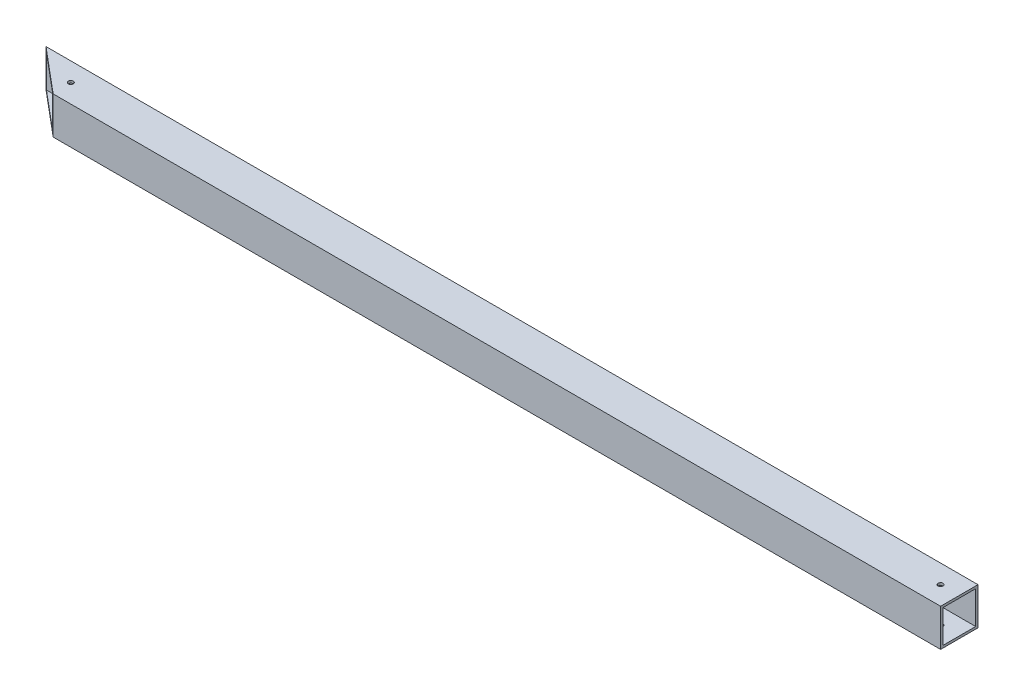
ISO-10303-21;
HEADER;
FILE_DESCRIPTION(('STEP AP214'),'2;1');
FILE_NAME('part.step','',(''),(''),'','','');
FILE_SCHEMA(('AUTOMOTIVE_DESIGN { 1 0 10303 214 1 1 1 1 }'));
ENDSEC;
DATA;
#1=APPLICATION_CONTEXT('core data for automotive mechanical design processes');
#2=APPLICATION_PROTOCOL_DEFINITION('international standard','automotive_design',2000,#1);
#3=PRODUCT_CONTEXT('',#1,'mechanical');
#4=PRODUCT('Part','Part','',(#3));
#5=PRODUCT_RELATED_PRODUCT_CATEGORY('part','',(#4));
#6=PRODUCT_DEFINITION_FORMATION('','',#4);
#7=PRODUCT_DEFINITION_CONTEXT('part definition',#1,'design');
#8=PRODUCT_DEFINITION('design','',#6,#7);
#9=PRODUCT_DEFINITION_SHAPE('','',#8);
#10=(LENGTH_UNIT() NAMED_UNIT(*) SI_UNIT(.MILLI.,.METRE.));
#11=(NAMED_UNIT(*) PLANE_ANGLE_UNIT() SI_UNIT($,.RADIAN.));
#12=(NAMED_UNIT(*) SI_UNIT($,.STERADIAN.) SOLID_ANGLE_UNIT());
#13=UNCERTAINTY_MEASURE_WITH_UNIT(LENGTH_MEASURE(1.E-05),#10,'distance_accuracy_value','');
#14=(GEOMETRIC_REPRESENTATION_CONTEXT(3) GLOBAL_UNCERTAINTY_ASSIGNED_CONTEXT((#13)) GLOBAL_UNIT_ASSIGNED_CONTEXT((#10,
#11,#12)) REPRESENTATION_CONTEXT('',''));
#15=CARTESIAN_POINT('',(0.,0.,0.));
#16=DIRECTION('',(0.,0.,1.));
#17=DIRECTION('',(1.,0.,0.));
#18=AXIS2_PLACEMENT_3D('',#15,#16,#17);
#19=CARTESIAN_POINT('',(1434.71069902318,-215.9,1156.61312053318));
#20=DIRECTION('',(1.,0.,0.));
#21=DIRECTION('',(0.,0.,-1.));
#22=AXIS2_PLACEMENT_3D('',#19,#20,#21);
#23=PLANE('',#22);
#24=DIRECTION('',(0.,0.,-1.));
#25=VECTOR('',#24,1.);
#26=CARTESIAN_POINT('',(1434.71069902318,-165.1,1156.61312053318));
#27=LINE('',#26,#25);
#28=CARTESIAN_POINT('',(1434.71069902318,-165.1,177.8));
#29=VERTEX_POINT('',#28);
#30=CARTESIAN_POINT('',(1434.71069902318,-165.1,127.));
#31=VERTEX_POINT('',#30);
#32=EDGE_CURVE('E179',#29,#31,#27,.T.);
#33=ORIENTED_EDGE('',*,*,#32,.F.);
#34=DIRECTION('',(0.,1.,0.));
#35=VECTOR('',#34,1.);
#36=CARTESIAN_POINT('',(1434.71069902318,-215.9,177.8));
#37=LINE('',#36,#35);
#38=CARTESIAN_POINT('',(1434.71069902318,-215.9,177.8));
#39=VERTEX_POINT('',#38);
#40=EDGE_CURVE('E26',#39,#29,#37,.T.);
#41=ORIENTED_EDGE('',*,*,#40,.F.);
#42=DIRECTION('',(0.,0.,-1.));
#43=VECTOR('',#42,1.);
#44=CARTESIAN_POINT('',(1434.71069902318,-215.9,1156.61312053318));
#45=LINE('',#44,#43);
#46=CARTESIAN_POINT('',(1434.71069902318,-215.9,127.));
#47=VERTEX_POINT('',#46);
#48=EDGE_CURVE('E163',#39,#47,#45,.T.);
#49=ORIENTED_EDGE('',*,*,#48,.T.);
#50=DIRECTION('',(0.,1.,0.));
#51=VECTOR('',#50,1.);
#52=CARTESIAN_POINT('',(1434.71069902318,-215.9,127.));
#53=LINE('',#52,#51);
#54=EDGE_CURVE('E188',#47,#31,#53,.T.);
#55=ORIENTED_EDGE('',*,*,#54,.T.);
#56=EDGE_LOOP('',(#33,#41,#49,#55));
#57=FACE_BOUND('',#56,.T.);
#58=DIRECTION('',(0.,1.,0.));
#59=VECTOR('',#58,1.);
#60=CARTESIAN_POINT('',(1434.71069902318,-215.9,174.625));
#61=LINE('',#60,#59);
#62=CARTESIAN_POINT('',(1434.71069902318,-212.725,174.625));
#63=VERTEX_POINT('',#62);
#64=CARTESIAN_POINT('',(1434.71069902318,-168.275,174.625));
#65=VERTEX_POINT('',#64);
#66=EDGE_CURVE('E114',#63,#65,#61,.T.);
#67=ORIENTED_EDGE('',*,*,#66,.T.);
#68=DIRECTION('',(0.,0.,-1.));
#69=VECTOR('',#68,1.);
#70=CARTESIAN_POINT('',(1434.71069902318,-168.275,637.655198226429));
#71=LINE('',#70,#69);
#72=CARTESIAN_POINT('',(1434.71069902318,-168.275,130.175));
#73=VERTEX_POINT('',#72);
#74=EDGE_CURVE('E123',#65,#73,#71,.T.);
#75=ORIENTED_EDGE('',*,*,#74,.T.);
#76=DIRECTION('',(0.,1.,0.));
#77=VECTOR('',#76,1.);
#78=CARTESIAN_POINT('',(1434.71069902318,-215.9,130.175));
#79=LINE('',#78,#77);
#80=CARTESIAN_POINT('',(1434.71069902318,-212.725,130.175));
#81=VERTEX_POINT('',#80);
#82=EDGE_CURVE('E141',#81,#73,#79,.T.);
#83=ORIENTED_EDGE('',*,*,#82,.F.);
#84=DIRECTION('',(0.,0.,-1.));
#85=VECTOR('',#84,1.);
#86=CARTESIAN_POINT('',(1434.71069902318,-212.725,637.655198226429));
#87=LINE('',#86,#85);
#88=EDGE_CURVE('E147',#63,#81,#87,.T.);
#89=ORIENTED_EDGE('',*,*,#88,.F.);
#90=EDGE_LOOP('',(#67,#75,#83,#89));
#91=FACE_BOUND('',#90,.T.);
#92=ADVANCED_FACE('F16',(#57,#91),#23,.T.);
#93=CARTESIAN_POINT('',(168.755680010826,-215.9,126.74379662104));
#94=DIRECTION('',(0.64278760968654,0.,-0.766044443118978));
#95=DIRECTION('',(-0.766044443118978,0.,-0.64278760968654));
#96=AXIS2_PLACEMENT_3D('',#93,#94,#95);
#97=PLANE('',#96);
#98=DIRECTION('',(-0.766044443118978,0.,-0.64278760968654));
#99=VECTOR('',#98,1.);
#100=CARTESIAN_POINT('',(168.755680010826,-165.1,126.74379662104));
#101=LINE('',#100,#99);
#102=CARTESIAN_POINT('',(229.602093811922,-165.1,177.8));
#103=VERTEX_POINT('',#102);
#104=CARTESIAN_POINT('',(169.061011308136,-165.1,127.));
#105=VERTEX_POINT('',#104);
#106=EDGE_CURVE('E113',#103,#105,#101,.T.);
#107=ORIENTED_EDGE('',*,*,#106,.T.);
#108=DIRECTION('',(0.,1.,0.));
#109=VECTOR('',#108,1.);
#110=CARTESIAN_POINT('',(169.061011308136,-215.9,127.));
#111=LINE('',#110,#109);
#112=CARTESIAN_POINT('',(169.061011308136,-215.9,127.));
#113=VERTEX_POINT('',#112);
#114=EDGE_CURVE('E171',#113,#105,#111,.T.);
#115=ORIENTED_EDGE('',*,*,#114,.F.);
#116=DIRECTION('',(-0.766044443118978,0.,-0.64278760968654));
#117=VECTOR('',#116,1.);
#118=CARTESIAN_POINT('',(168.755680010826,-215.9,126.74379662104));
#119=LINE('',#118,#117);
#120=CARTESIAN_POINT('',(229.602093811922,-215.9,177.8));
#121=VERTEX_POINT('',#120);
#122=EDGE_CURVE('E154',#121,#113,#119,.T.);
#123=ORIENTED_EDGE('',*,*,#122,.F.);
#124=DIRECTION('',(0.,1.,0.));
#125=VECTOR('',#124,1.);
#126=CARTESIAN_POINT('',(229.602093811922,-215.9,177.8));
#127=LINE('',#126,#125);
#128=EDGE_CURVE('E11',#121,#103,#127,.T.);
#129=ORIENTED_EDGE('',*,*,#128,.T.);
#130=EDGE_LOOP('',(#107,#115,#123,#129));
#131=FACE_BOUND('',#130,.T.);
#132=DIRECTION('',(-0.766044443118978,0.,-0.64278760968654));
#133=VECTOR('',#132,1.);
#134=CARTESIAN_POINT('',(735.042836195444,-168.275,601.915140515985));
#135=LINE('',#134,#133);
#136=CARTESIAN_POINT('',(225.818276155435,-168.275,174.625));
#137=VERTEX_POINT('',#136);
#138=CARTESIAN_POINT('',(172.844828964622,-168.275,130.175));
#139=VERTEX_POINT('',#138);
#140=EDGE_CURVE('E120',#137,#139,#135,.T.);
#141=ORIENTED_EDGE('',*,*,#140,.F.);
#142=DIRECTION('',(0.,1.,0.));
#143=VECTOR('',#142,1.);
#144=CARTESIAN_POINT('',(225.818276155435,-215.9,174.625));
#145=LINE('',#144,#143);
#146=CARTESIAN_POINT('',(225.818276155435,-212.725,174.625));
#147=VERTEX_POINT('',#146);
#148=EDGE_CURVE('E104',#147,#137,#145,.T.);
#149=ORIENTED_EDGE('',*,*,#148,.F.);
#150=DIRECTION('',(-0.766044443118978,0.,-0.64278760968654));
#151=VECTOR('',#150,1.);
#152=CARTESIAN_POINT('',(735.042836195444,-212.725,601.915140515985));
#153=LINE('',#152,#151);
#154=CARTESIAN_POINT('',(172.844828964622,-212.725,130.175));
#155=VERTEX_POINT('',#154);
#156=EDGE_CURVE('E50',#147,#155,#153,.T.);
#157=ORIENTED_EDGE('',*,*,#156,.T.);
#158=DIRECTION('',(0.,1.,0.));
#159=VECTOR('',#158,1.);
#160=CARTESIAN_POINT('',(172.844828964622,-215.9,130.175));
#161=LINE('',#160,#159);
#162=EDGE_CURVE('E126',#155,#139,#161,.T.);
#163=ORIENTED_EDGE('',*,*,#162,.T.);
#164=EDGE_LOOP('',(#141,#149,#157,#163));
#165=FACE_BOUND('',#164,.T.);
#166=ADVANCED_FACE('F18',(#131,#165),#97,.F.);
#167=CARTESIAN_POINT('',(686.616627278044,-215.9,177.8));
#168=DIRECTION('',(0.,0.,-1.));
#169=DIRECTION('',(-1.,0.,0.));
#170=AXIS2_PLACEMENT_3D('',#167,#168,#169);
#171=PLANE('',#170);
#172=DIRECTION('',(-1.,0.,0.));
#173=VECTOR('',#172,1.);
#174=CARTESIAN_POINT('',(686.616627278044,-165.1,177.8));
#175=LINE('',#174,#173);
#176=EDGE_CURVE('E175',#29,#103,#175,.T.);
#177=ORIENTED_EDGE('',*,*,#176,.T.);
#178=ORIENTED_EDGE('',*,*,#128,.F.);
#179=DIRECTION('',(-1.,0.,0.));
#180=VECTOR('',#179,1.);
#181=CARTESIAN_POINT('',(686.616627278044,-215.9,177.8));
#182=LINE('',#181,#180);
#183=EDGE_CURVE('E158',#39,#121,#182,.T.);
#184=ORIENTED_EDGE('',*,*,#183,.F.);
#185=ORIENTED_EDGE('',*,*,#40,.T.);
#186=EDGE_LOOP('',(#177,#178,#184,#185));
#187=FACE_BOUND('',#186,.T.);
#188=ADVANCED_FACE('F245',(#187),#171,.F.);
#189=CARTESIAN_POINT('',(661.181740408425,-215.9,127.));
#190=DIRECTION('',(0.,0.,1.));
#191=DIRECTION('',(1.,0.,0.));
#192=AXIS2_PLACEMENT_3D('',#189,#190,#191);
#193=PLANE('',#192);
#194=DIRECTION('',(1.,0.,0.));
#195=VECTOR('',#194,1.);
#196=CARTESIAN_POINT('',(661.181740408425,-165.1,127.));
#197=LINE('',#196,#195);
#198=EDGE_CURVE('E159',#105,#31,#197,.T.);
#199=ORIENTED_EDGE('',*,*,#198,.T.);
#200=ORIENTED_EDGE('',*,*,#54,.F.);
#201=DIRECTION('',(1.,0.,0.));
#202=VECTOR('',#201,1.);
#203=CARTESIAN_POINT('',(661.181740408425,-215.9,127.));
#204=LINE('',#203,#202);
#205=EDGE_CURVE('E167',#113,#47,#204,.T.);
#206=ORIENTED_EDGE('',*,*,#205,.F.);
#207=ORIENTED_EDGE('',*,*,#114,.T.);
#208=EDGE_LOOP('',(#199,#200,#206,#207));
#209=FACE_BOUND('',#208,.T.);
#210=ADVANCED_FACE('F249',(#209),#193,.F.);
#211=CARTESIAN_POINT('',(705.053366952356,-215.9,637.655198226429));
#212=DIRECTION('',(0.,1.,0.));
#213=DIRECTION('',(-1.,0.,0.));
#214=AXIS2_PLACEMENT_3D('',#211,#212,#213);
#215=PLANE('',#214);
#216=CARTESIAN_POINT('',(228.210699023183,-215.9,152.4));
#217=DIRECTION('',(0.,-1.,0.));
#218=DIRECTION('',(0.,0.,-1.));
#219=AXIS2_PLACEMENT_3D('',#216,#217,#218);
#220=CIRCLE('',#219,3.3782);
#221=CARTESIAN_POINT('',(228.210699023183,-215.9,149.0218));
#222=VERTEX_POINT('',#221);
#223=EDGE_CURVE('E278',#222,#222,#220,.T.);
#224=ORIENTED_EDGE('',*,*,#223,.F.);
#225=EDGE_LOOP('',(#224));
#226=FACE_BOUND('',#225,.T.);
#227=CARTESIAN_POINT('',(1409.31069902318,-215.9,152.4));
#228=DIRECTION('',(0.,1.,0.));
#229=DIRECTION('',(0.,0.,1.));
#230=AXIS2_PLACEMENT_3D('',#227,#228,#229);
#231=CIRCLE('',#230,3.36549999999991);
#232=CARTESIAN_POINT('',(1409.31069902318,-215.9,155.7655));
#233=VERTEX_POINT('',#232);
#234=EDGE_CURVE('E128',#233,#233,#231,.F.);
#235=ORIENTED_EDGE('',*,*,#234,.F.);
#236=EDGE_LOOP('',(#235));
#237=FACE_BOUND('',#236,.T.);
#238=ORIENTED_EDGE('',*,*,#122,.T.);
#239=ORIENTED_EDGE('',*,*,#205,.T.);
#240=ORIENTED_EDGE('',*,*,#48,.F.);
#241=ORIENTED_EDGE('',*,*,#183,.T.);
#242=EDGE_LOOP('',(#238,#239,#240,#241));
#243=FACE_BOUND('',#242,.T.);
#244=ADVANCED_FACE('F256',(#226,#237,#243),#215,.F.);
#245=CARTESIAN_POINT('',(705.053366952356,-165.1,637.655198226429));
#246=DIRECTION('',(0.,1.,0.));
#247=DIRECTION('',(-1.,0.,0.));
#248=AXIS2_PLACEMENT_3D('',#245,#246,#247);
#249=PLANE('',#248);
#250=CARTESIAN_POINT('',(228.210699023183,-165.1,152.4));
#251=DIRECTION('',(0.,1.,0.));
#252=DIRECTION('',(0.,0.,1.));
#253=AXIS2_PLACEMENT_3D('',#250,#251,#252);
#254=CIRCLE('',#253,3.3782);
#255=CARTESIAN_POINT('',(228.210699023183,-165.1,155.7782));
#256=VERTEX_POINT('',#255);
#257=EDGE_CURVE('E204',#256,#256,#254,.F.);
#258=ORIENTED_EDGE('',*,*,#257,.T.);
#259=EDGE_LOOP('',(#258));
#260=FACE_BOUND('',#259,.T.);
#261=CARTESIAN_POINT('',(1409.31069902318,-165.1,152.4));
#262=DIRECTION('',(0.,1.,0.));
#263=DIRECTION('',(0.,0.,1.));
#264=AXIS2_PLACEMENT_3D('',#261,#262,#263);
#265=CIRCLE('',#264,3.36549999999991);
#266=CARTESIAN_POINT('',(1409.31069902318,-165.1,155.7655));
#267=VERTEX_POINT('',#266);
#268=EDGE_CURVE('E195',#267,#267,#265,.T.);
#269=ORIENTED_EDGE('',*,*,#268,.F.);
#270=EDGE_LOOP('',(#269));
#271=FACE_BOUND('',#270,.T.);
#272=ORIENTED_EDGE('',*,*,#106,.F.);
#273=ORIENTED_EDGE('',*,*,#176,.F.);
#274=ORIENTED_EDGE('',*,*,#32,.T.);
#275=ORIENTED_EDGE('',*,*,#198,.F.);
#276=EDGE_LOOP('',(#272,#273,#274,#275));
#277=FACE_BOUND('',#276,.T.);
#278=ADVANCED_FACE('F263',(#260,#271,#277),#249,.T.);
#279=CARTESIAN_POINT('',(686.616627278044,-215.9,174.625));
#280=DIRECTION('',(0.,0.,-1.));
#281=DIRECTION('',(-1.,0.,0.));
#282=AXIS2_PLACEMENT_3D('',#279,#280,#281);
#283=PLANE('',#282);
#284=DIRECTION('',(-1.,0.,0.));
#285=VECTOR('',#284,1.);
#286=CARTESIAN_POINT('',(705.053366952356,-168.275,174.625));
#287=LINE('',#286,#285);
#288=EDGE_CURVE('E107',#65,#137,#287,.T.);
#289=ORIENTED_EDGE('',*,*,#288,.F.);
#290=ORIENTED_EDGE('',*,*,#66,.F.);
#291=DIRECTION('',(-1.,0.,0.));
#292=VECTOR('',#291,1.);
#293=CARTESIAN_POINT('',(705.053366952356,-212.725,174.625));
#294=LINE('',#293,#292);
#295=EDGE_CURVE('E109',#63,#147,#294,.T.);
#296=ORIENTED_EDGE('',*,*,#295,.T.);
#297=ORIENTED_EDGE('',*,*,#148,.T.);
#298=EDGE_LOOP('',(#289,#290,#296,#297));
#299=FACE_BOUND('',#298,.T.);
#300=ADVANCED_FACE('F106',(#299),#283,.T.);
#301=CARTESIAN_POINT('',(661.181740408425,-215.9,130.175));
#302=DIRECTION('',(0.,0.,1.));
#303=DIRECTION('',(1.,0.,0.));
#304=AXIS2_PLACEMENT_3D('',#301,#302,#303);
#305=PLANE('',#304);
#306=DIRECTION('',(1.,0.,0.));
#307=VECTOR('',#306,1.);
#308=CARTESIAN_POINT('',(705.053366952356,-168.275,130.175));
#309=LINE('',#308,#307);
#310=EDGE_CURVE('E144',#139,#73,#309,.T.);
#311=ORIENTED_EDGE('',*,*,#310,.F.);
#312=ORIENTED_EDGE('',*,*,#162,.F.);
#313=DIRECTION('',(1.,0.,0.));
#314=VECTOR('',#313,1.);
#315=CARTESIAN_POINT('',(705.053366952356,-212.725,130.175));
#316=LINE('',#315,#314);
#317=EDGE_CURVE('E39',#155,#81,#316,.T.);
#318=ORIENTED_EDGE('',*,*,#317,.T.);
#319=ORIENTED_EDGE('',*,*,#82,.T.);
#320=EDGE_LOOP('',(#311,#312,#318,#319));
#321=FACE_BOUND('',#320,.T.);
#322=ADVANCED_FACE('F225',(#321),#305,.T.);
#323=CARTESIAN_POINT('',(705.053366952356,-212.725,637.655198226429));
#324=DIRECTION('',(0.,1.,0.));
#325=DIRECTION('',(-1.,0.,0.));
#326=AXIS2_PLACEMENT_3D('',#323,#324,#325);
#327=PLANE('',#326);
#328=CARTESIAN_POINT('',(228.210699023183,-212.725,152.4));
#329=DIRECTION('',(0.,1.,0.));
#330=DIRECTION('',(0.,0.,1.));
#331=AXIS2_PLACEMENT_3D('',#328,#329,#330);
#332=CIRCLE('',#331,3.3782);
#333=CARTESIAN_POINT('',(228.210699023183,-212.725,155.7782));
#334=VERTEX_POINT('',#333);
#335=EDGE_CURVE('E211',#334,#334,#332,.F.);
#336=ORIENTED_EDGE('',*,*,#335,.T.);
#337=EDGE_LOOP('',(#336));
#338=FACE_BOUND('',#337,.T.);
#339=CARTESIAN_POINT('',(1409.31069902318,-212.725,152.4));
#340=DIRECTION('',(0.,1.,0.));
#341=DIRECTION('',(0.,0.,1.));
#342=AXIS2_PLACEMENT_3D('',#339,#340,#341);
#343=CIRCLE('',#342,3.36549999999991);
#344=CARTESIAN_POINT('',(1409.31069902318,-212.725,155.7655));
#345=VERTEX_POINT('',#344);
#346=EDGE_CURVE('E135',#345,#345,#343,.F.);
#347=ORIENTED_EDGE('',*,*,#346,.T.);
#348=EDGE_LOOP('',(#347));
#349=FACE_BOUND('',#348,.T.);
#350=ORIENTED_EDGE('',*,*,#156,.F.);
#351=ORIENTED_EDGE('',*,*,#295,.F.);
#352=ORIENTED_EDGE('',*,*,#88,.T.);
#353=ORIENTED_EDGE('',*,*,#317,.F.);
#354=EDGE_LOOP('',(#350,#351,#352,#353));
#355=FACE_BOUND('',#354,.T.);
#356=ADVANCED_FACE('F223',(#338,#349,#355),#327,.T.);
#357=CARTESIAN_POINT('',(705.053366952356,-168.275,637.655198226429));
#358=DIRECTION('',(0.,1.,0.));
#359=DIRECTION('',(-1.,0.,0.));
#360=AXIS2_PLACEMENT_3D('',#357,#358,#359);
#361=PLANE('',#360);
#362=CARTESIAN_POINT('',(228.210699023183,-168.275,152.4));
#363=DIRECTION('',(0.,1.,0.));
#364=DIRECTION('',(0.,0.,1.));
#365=AXIS2_PLACEMENT_3D('',#362,#363,#364);
#366=CIRCLE('',#365,3.3782);
#367=CARTESIAN_POINT('',(228.210699023183,-168.275,155.7782));
#368=VERTEX_POINT('',#367);
#369=EDGE_CURVE('E20',#368,#368,#366,.F.);
#370=ORIENTED_EDGE('',*,*,#369,.F.);
#371=EDGE_LOOP('',(#370));
#372=FACE_BOUND('',#371,.T.);
#373=CARTESIAN_POINT('',(1409.31069902318,-168.275,152.4));
#374=DIRECTION('',(0.,1.,0.));
#375=DIRECTION('',(0.,0.,1.));
#376=AXIS2_PLACEMENT_3D('',#373,#374,#375);
#377=CIRCLE('',#376,3.36549999999991);
#378=CARTESIAN_POINT('',(1409.31069902318,-168.275,155.7655));
#379=VERTEX_POINT('',#378);
#380=EDGE_CURVE('E192',#379,#379,#377,.F.);
#381=ORIENTED_EDGE('',*,*,#380,.F.);
#382=EDGE_LOOP('',(#381));
#383=FACE_BOUND('',#382,.T.);
#384=ORIENTED_EDGE('',*,*,#140,.T.);
#385=ORIENTED_EDGE('',*,*,#310,.T.);
#386=ORIENTED_EDGE('',*,*,#74,.F.);
#387=ORIENTED_EDGE('',*,*,#288,.T.);
#388=EDGE_LOOP('',(#384,#385,#386,#387));
#389=FACE_BOUND('',#388,.T.);
#390=ADVANCED_FACE('F118',(#372,#383,#389),#361,.F.);
#391=CARTESIAN_POINT('',(1409.31069902318,-1433.79813056647,152.4));
#392=DIRECTION('',(0.,1.,0.));
#393=DIRECTION('',(0.,0.,1.));
#394=AXIS2_PLACEMENT_3D('',#391,#392,#393);
#395=CYLINDRICAL_SURFACE('',#394,3.36549999999991);
#396=ORIENTED_EDGE('',*,*,#268,.T.);
#397=EDGE_LOOP('',(#396));
#398=FACE_BOUND('',#397,.T.);
#399=ORIENTED_EDGE('',*,*,#380,.T.);
#400=EDGE_LOOP('',(#399));
#401=FACE_BOUND('',#400,.T.);
#402=ADVANCED_FACE('F233',(#398,#401),#395,.F.);
#403=ORIENTED_EDGE('',*,*,#346,.F.);
#404=EDGE_LOOP('',(#403));
#405=FACE_BOUND('',#404,.T.);
#406=ORIENTED_EDGE('',*,*,#234,.T.);
#407=EDGE_LOOP('',(#406));
#408=FACE_BOUND('',#407,.T.);
#409=ADVANCED_FACE('F281',(#405,#408),#395,.F.);
#410=CARTESIAN_POINT('',(228.210699023183,1715.91155852403,152.4));
#411=DIRECTION('',(0.,-1.,0.));
#412=DIRECTION('',(0.,0.,-1.));
#413=AXIS2_PLACEMENT_3D('',#410,#411,#412);
#414=CYLINDRICAL_SURFACE('',#413,3.3782);
#415=ORIENTED_EDGE('',*,*,#257,.F.);
#416=EDGE_LOOP('',(#415));
#417=FACE_BOUND('',#416,.T.);
#418=ORIENTED_EDGE('',*,*,#369,.T.);
#419=EDGE_LOOP('',(#418));
#420=FACE_BOUND('',#419,.T.);
#421=ADVANCED_FACE('F283',(#417,#420),#414,.F.);
#422=ORIENTED_EDGE('',*,*,#335,.F.);
#423=EDGE_LOOP('',(#422));
#424=FACE_BOUND('',#423,.T.);
#425=ORIENTED_EDGE('',*,*,#223,.T.);
#426=EDGE_LOOP('',(#425));
#427=FACE_BOUND('',#426,.T.);
#428=ADVANCED_FACE('F290',(#424,#427),#414,.F.);
#429=CLOSED_SHELL('',(#92,#166,#188,#210,#244,#278,#300,#322,#356,#390,#402,#409,#421,#428));
#430=MANIFOLD_SOLID_BREP('B1',#429);
#431=ADVANCED_BREP_SHAPE_REPRESENTATION('',(#18,#430),#14);
#432=SHAPE_DEFINITION_REPRESENTATION(#9,#431);
ENDSEC;
END-ISO-10303-21;
